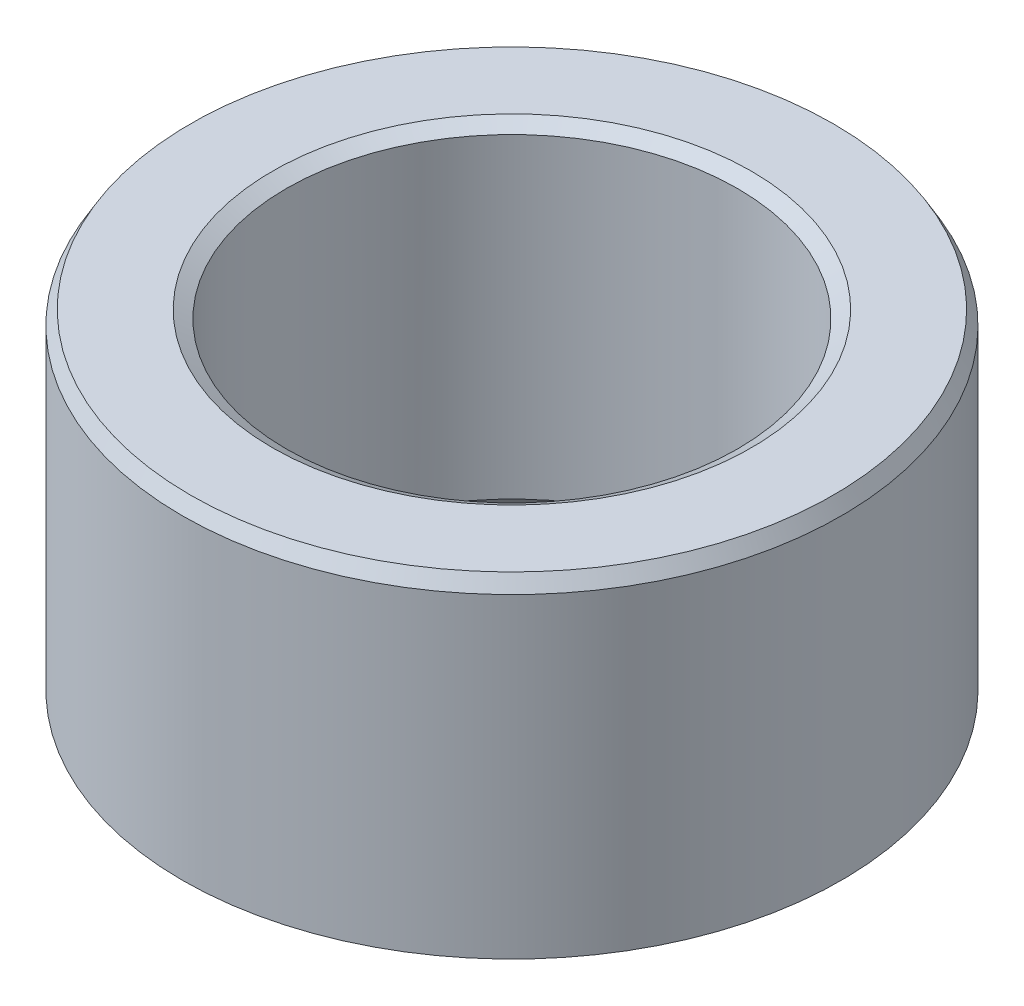
ISO-10303-21;
HEADER;
FILE_DESCRIPTION(('STEP AP214'),'2;1');
FILE_NAME('part.step','',(''),(''),'','','');
FILE_SCHEMA(('AUTOMOTIVE_DESIGN { 1 0 10303 214 1 1 1 1 }'));
ENDSEC;
DATA;
#1=APPLICATION_CONTEXT('core data for automotive mechanical design processes');
#2=APPLICATION_PROTOCOL_DEFINITION('international standard','automotive_design',2000,#1);
#3=PRODUCT_CONTEXT('',#1,'mechanical');
#4=PRODUCT('Part','Part','',(#3));
#5=PRODUCT_RELATED_PRODUCT_CATEGORY('part','',(#4));
#6=PRODUCT_DEFINITION_FORMATION('','',#4);
#7=PRODUCT_DEFINITION_CONTEXT('part definition',#1,'design');
#8=PRODUCT_DEFINITION('design','',#6,#7);
#9=PRODUCT_DEFINITION_SHAPE('','',#8);
#10=(LENGTH_UNIT() NAMED_UNIT(*) SI_UNIT(.MILLI.,.METRE.));
#11=(NAMED_UNIT(*) PLANE_ANGLE_UNIT() SI_UNIT($,.RADIAN.));
#12=(NAMED_UNIT(*) SI_UNIT($,.STERADIAN.) SOLID_ANGLE_UNIT());
#13=UNCERTAINTY_MEASURE_WITH_UNIT(LENGTH_MEASURE(1.E-05),#10,'distance_accuracy_value','');
#14=(GEOMETRIC_REPRESENTATION_CONTEXT(3) GLOBAL_UNCERTAINTY_ASSIGNED_CONTEXT((#13)) GLOBAL_UNIT_ASSIGNED_CONTEXT((#10,
#11,#12)) REPRESENTATION_CONTEXT('',''));
#15=CARTESIAN_POINT('',(0.,0.,0.));
#16=DIRECTION('',(0.,0.,1.));
#17=DIRECTION('',(1.,0.,0.));
#18=AXIS2_PLACEMENT_3D('',#15,#16,#17);
#19=CARTESIAN_POINT('',(0.,17.9271882621692,0.));
#20=DIRECTION('',(0.,-1.,0.));
#21=DIRECTION('',(0.,0.,-1.));
#22=AXIS2_PLACEMENT_3D('',#19,#20,#21);
#23=CYLINDRICAL_SURFACE('',#22,17.5);
#24=CARTESIAN_POINT('',(0.,0.426756121001234,0.));
#25=DIRECTION('',(0.,1.,0.));
#26=DIRECTION('',(0.,0.,1.));
#27=AXIS2_PLACEMENT_3D('',#24,#25,#26);
#28=CIRCLE('',#27,17.5);
#29=CARTESIAN_POINT('',(0.,0.426756121001234,17.5));
#30=VERTEX_POINT('',#29);
#31=EDGE_CURVE('E10',#30,#30,#28,.T.);
#32=ORIENTED_EDGE('',*,*,#31,.T.);
#33=EDGE_LOOP('',(#32));
#34=FACE_BOUND('',#33,.T.);
#35=CARTESIAN_POINT('',(0.,17.1880249781541,0.));
#36=DIRECTION('',(0.,1.,0.));
#37=DIRECTION('',(0.,0.,1.));
#38=AXIS2_PLACEMENT_3D('',#35,#36,#37);
#39=CIRCLE('',#38,17.5);
#40=CARTESIAN_POINT('',(0.,17.1880249781541,17.5));
#41=VERTEX_POINT('',#40);
#42=EDGE_CURVE('E50',#41,#41,#39,.F.);
#43=ORIENTED_EDGE('',*,*,#42,.T.);
#44=EDGE_LOOP('',(#43));
#45=FACE_BOUND('',#44,.T.);
#46=ADVANCED_FACE('F39',(#34,#45),#23,.T.);
#47=CARTESIAN_POINT('',(0.,17.9271882621692,0.));
#48=DIRECTION('',(0.,1.,0.));
#49=DIRECTION('',(0.,0.,1.));
#50=AXIS2_PLACEMENT_3D('',#47,#48,#49);
#51=PLANE('',#50);
#52=CARTESIAN_POINT('',(0.,17.9271882621692,0.));
#53=DIRECTION('',(0.,1.,0.));
#54=DIRECTION('',(0.,0.,1.));
#55=AXIS2_PLACEMENT_3D('',#52,#53,#54);
#56=CIRCLE('',#55,12.7193920259785);
#57=CARTESIAN_POINT('',(0.,17.9271882621692,12.7193920259785));
#58=VERTEX_POINT('',#57);
#59=EDGE_CURVE('E58',#58,#58,#56,.F.);
#60=ORIENTED_EDGE('',*,*,#59,.T.);
#61=EDGE_LOOP('',(#60));
#62=FACE_BOUND('',#61,.T.);
#63=CARTESIAN_POINT('',(0.,17.9271882621692,0.));
#64=DIRECTION('',(0.,1.,0.));
#65=DIRECTION('',(0.,0.,1.));
#66=AXIS2_PLACEMENT_3D('',#63,#64,#65);
#67=CIRCLE('',#66,17.0732438789988);
#68=CARTESIAN_POINT('',(0.,17.9271882621692,17.0732438789988));
#69=VERTEX_POINT('',#68);
#70=EDGE_CURVE('E61',#69,#69,#67,.T.);
#71=ORIENTED_EDGE('',*,*,#70,.T.);
#72=EDGE_LOOP('',(#71));
#73=FACE_BOUND('',#72,.T.);
#74=ADVANCED_FACE('F88',(#62,#73),#51,.T.);
#75=CARTESIAN_POINT('',(0.,0.,0.));
#76=DIRECTION('',(0.,1.,0.));
#77=DIRECTION('',(0.,0.,1.));
#78=AXIS2_PLACEMENT_3D('',#75,#76,#77);
#79=PLANE('',#78);
#80=CARTESIAN_POINT('',(0.,0.,0.));
#81=DIRECTION('',(0.,1.,0.));
#82=DIRECTION('',(0.,0.,1.));
#83=AXIS2_PLACEMENT_3D('',#80,#81,#82);
#84=CIRCLE('',#83,12.4069848629646);
#85=CARTESIAN_POINT('',(0.,0.,-12.4069848629646));
#86=VERTEX_POINT('',#85);
#87=EDGE_CURVE('E51',#86,#86,#84,.T.);
#88=ORIENTED_EDGE('',*,*,#87,.T.);
#89=EDGE_LOOP('',(#88));
#90=FACE_BOUND('',#89,.T.);
#91=CARTESIAN_POINT('',(0.,0.,0.));
#92=DIRECTION('',(0.,1.,0.));
#93=DIRECTION('',(0.,0.,1.));
#94=AXIS2_PLACEMENT_3D('',#91,#92,#93);
#95=CIRCLE('',#94,16.7608367159848);
#96=CARTESIAN_POINT('',(0.,0.,16.7608367159848));
#97=VERTEX_POINT('',#96);
#98=EDGE_CURVE('E54',#97,#97,#95,.F.);
#99=ORIENTED_EDGE('',*,*,#98,.T.);
#100=EDGE_LOOP('',(#99));
#101=FACE_BOUND('',#100,.T.);
#102=ADVANCED_FACE('F83',(#90,#101),#79,.F.);
#103=CARTESIAN_POINT('',(0.,17.9271882621692,0.));
#104=DIRECTION('',(0.,-1.,0.));
#105=DIRECTION('',(0.,0.,-1.));
#106=AXIS2_PLACEMENT_3D('',#103,#104,#105);
#107=CYLINDRICAL_SURFACE('',#106,11.9802287419634);
#108=CARTESIAN_POINT('',(0.,17.500432141168,0.));
#109=DIRECTION('',(0.,1.,0.));
#110=DIRECTION('',(0.,0.,1.));
#111=AXIS2_PLACEMENT_3D('',#108,#109,#110);
#112=CIRCLE('',#111,11.9802287419634);
#113=CARTESIAN_POINT('',(0.,17.500432141168,11.9802287419634));
#114=VERTEX_POINT('',#113);
#115=EDGE_CURVE('E67',#114,#114,#112,.T.);
#116=ORIENTED_EDGE('',*,*,#115,.T.);
#117=EDGE_LOOP('',(#116));
#118=FACE_BOUND('',#117,.T.);
#119=CARTESIAN_POINT('',(0.,0.739163284015149,0.));
#120=DIRECTION('',(0.,1.,0.));
#121=DIRECTION('',(0.,0.,1.));
#122=AXIS2_PLACEMENT_3D('',#119,#120,#121);
#123=CIRCLE('',#122,11.9802287419634);
#124=CARTESIAN_POINT('',(0.,0.739163284015149,-11.9802287419634));
#125=VERTEX_POINT('',#124);
#126=EDGE_CURVE('E69',#125,#125,#123,.F.);
#127=ORIENTED_EDGE('',*,*,#126,.T.);
#128=EDGE_LOOP('',(#127));
#129=FACE_BOUND('',#128,.T.);
#130=ADVANCED_FACE('F71',(#118,#129),#107,.F.);
#131=CARTESIAN_POINT('',(0.,17.500432141168,0.));
#132=DIRECTION('',(0.,1.,0.));
#133=DIRECTION('',(0.,0.,1.));
#134=AXIS2_PLACEMENT_3D('',#131,#132,#133);
#135=CONICAL_SURFACE('',#134,11.9802287419634,1.0471975511966);
#136=ORIENTED_EDGE('',*,*,#59,.F.);
#137=EDGE_LOOP('',(#136));
#138=FACE_BOUND('',#137,.T.);
#139=ORIENTED_EDGE('',*,*,#115,.F.);
#140=EDGE_LOOP('',(#139));
#141=FACE_BOUND('',#140,.T.);
#142=ADVANCED_FACE('F77',(#138,#141),#135,.F.);
#143=CARTESIAN_POINT('',(0.,0.,0.));
#144=DIRECTION('',(0.,-1.,0.));
#145=DIRECTION('',(0.,0.,-1.));
#146=AXIS2_PLACEMENT_3D('',#143,#144,#145);
#147=CONICAL_SURFACE('',#146,12.4069848629646,0.523598775598295);
#148=CARTESIAN_POINT('',(0.,0.739163284015149,-11.9802287419634));
#149=CARTESIAN_POINT('',(0.,0.731463666473325,-11.9846741182238));
#150=CARTESIAN_POINT('',(0.,0.7237640489315,-11.9891194944842));
#151=CARTESIAN_POINT('',(0.,0.708364813847851,-11.9980102470051));
#152=CARTESIAN_POINT('',(0.,0.700665196306027,-12.0024556232655));
#153=CARTESIAN_POINT('',(0.,0.685265961222378,-12.0113463757864));
#154=CARTESIAN_POINT('',(0.,0.677566343680554,-12.0157917520468));
#155=CARTESIAN_POINT('',(0.,0.662167108596905,-12.0246825045677));
#156=CARTESIAN_POINT('',(0.,0.65446749105508,-12.0291278808281));
#157=CARTESIAN_POINT('',(0.,0.639068255971431,-12.038018633349));
#158=CARTESIAN_POINT('',(0.,0.631368638429606,-12.0424640096094));
#159=CARTESIAN_POINT('',(0.,0.615969403345958,-12.0513547621302));
#160=CARTESIAN_POINT('',(0.,0.608269785804133,-12.0558001383907));
#161=CARTESIAN_POINT('',(0.,0.592870550720484,-12.0646908909115));
#162=CARTESIAN_POINT('',(0.,0.58517093317866,-12.069136267172));
#163=CARTESIAN_POINT('',(0.,0.569771698095011,-12.0780270196928));
#164=CARTESIAN_POINT('',(0.,0.562072080553186,-12.0824723959533));
#165=CARTESIAN_POINT('',(0.,0.546672845469537,-12.0913631484741));
#166=CARTESIAN_POINT('',(0.,0.538973227927713,-12.0958085247345));
#167=CARTESIAN_POINT('',(0.,0.523573992844064,-12.1046992772554));
#168=CARTESIAN_POINT('',(0.,0.515874375302239,-12.1091446535158));
#169=CARTESIAN_POINT('',(0.,0.500475140218591,-12.1180354060367));
#170=CARTESIAN_POINT('',(0.,0.492775522676766,-12.1224807822971));
#171=CARTESIAN_POINT('',(0.,0.477376287593117,-12.131371534818));
#172=CARTESIAN_POINT('',(0.,0.469676670051293,-12.1358169110784));
#173=CARTESIAN_POINT('',(0.,0.454277434967644,-12.1447076635993));
#174=CARTESIAN_POINT('',(0.,0.446577817425819,-12.1491530398597));
#175=CARTESIAN_POINT('',(0.,0.43117858234217,-12.1580437923806));
#176=CARTESIAN_POINT('',(0.,0.423478964800346,-12.162489168641));
#177=CARTESIAN_POINT('',(0.,0.408079729716697,-12.1713799211618));
#178=CARTESIAN_POINT('',(0.,0.400380112174872,-12.1758252974223));
#179=CARTESIAN_POINT('',(0.,0.384980877091223,-12.1847160499431));
#180=CARTESIAN_POINT('',(0.,0.377281259549399,-12.1891614262036));
#181=CARTESIAN_POINT('',(0.,0.36188202446575,-12.1980521787244));
#182=CARTESIAN_POINT('',(0.,0.354182406923926,-12.2024975549848));
#183=CARTESIAN_POINT('',(0.,0.338783171840277,-12.2113883075057));
#184=CARTESIAN_POINT('',(0.,0.331083554298452,-12.2158336837661));
#185=CARTESIAN_POINT('',(0.,0.315684319214803,-12.224724436287));
#186=CARTESIAN_POINT('',(0.,0.307984701672979,-12.2291698125474));
#187=CARTESIAN_POINT('',(0.,0.29258546658933,-12.2380605650683));
#188=CARTESIAN_POINT('',(0.,0.284885849047505,-12.2425059413287));
#189=CARTESIAN_POINT('',(0.,0.269486613963856,-12.2513966938496));
#190=CARTESIAN_POINT('',(0.,0.261786996422032,-12.25584207011));
#191=CARTESIAN_POINT('',(0.,0.246387761338383,-12.2647328226309));
#192=CARTESIAN_POINT('',(0.,0.238688143796559,-12.2691781988913));
#193=CARTESIAN_POINT('',(0.,0.22328890871291,-12.2780689514121));
#194=CARTESIAN_POINT('',(0.,0.215589291171085,-12.2825143276726));
#195=CARTESIAN_POINT('',(0.,0.200190056087436,-12.2914050801934));
#196=CARTESIAN_POINT('',(0.,0.192490438545612,-12.2958504564539));
#197=CARTESIAN_POINT('',(0.,0.177091203461963,-12.3047412089747));
#198=CARTESIAN_POINT('',(0.,0.169391585920138,-12.3091865852352));
#199=CARTESIAN_POINT('',(0.,0.153992350836489,-12.318077337756));
#200=CARTESIAN_POINT('',(0.,0.146292733294665,-12.3225227140164));
#201=CARTESIAN_POINT('',(0.,0.130893498211016,-12.3314134665373));
#202=CARTESIAN_POINT('',(0.,0.123193880669191,-12.3358588427977));
#203=CARTESIAN_POINT('',(0.,0.107794645585543,-12.3447495953186));
#204=CARTESIAN_POINT('',(0.,0.100095028043718,-12.349194971579));
#205=CARTESIAN_POINT('',(0.,0.0846957929600693,-12.3580857240999));
#206=CARTESIAN_POINT('',(0.,0.0769961754182446,-12.3625311003603));
#207=CARTESIAN_POINT('',(0.,0.0615969403345956,-12.3714218528812));
#208=CARTESIAN_POINT('',(0.,0.0538973227927712,-12.3758672291416));
#209=CARTESIAN_POINT('',(0.,0.0384980877091224,-12.3847579816625));
#210=CARTESIAN_POINT('',(0.,0.0307984701672979,-12.3892033579229));
#211=CARTESIAN_POINT('',(0.,0.0153992350836489,-12.3980941104437));
#212=CARTESIAN_POINT('',(0.,0.00769961754182442,-12.4025394867042));
#213=CARTESIAN_POINT('',(0.,0.,-12.4069848629646));
#214=B_SPLINE_CURVE_WITH_KNOTS('',3,(#148,#149,#150,#151,#152,#153,#154,#155,#156,#157,#158,
#159,#160,#161,#162,#163,#164,#165,#166,#167,#168,#169,#170,#171,#172,#173,#174,#175,#176,#177,
#178,#179,#180,#181,#182,#183,#184,#185,#186,#187,#188,#189,#190,#191,#192,#193,#194,#195,#196,
#197,#198,#199,#200,#201,#202,#203,#204,#205,#206,#207,#208,#209,#210,#211,#212,#213),
.UNSPECIFIED.,.F.,.F.,(4,2,2,2,2,2,2,2,2,2,2,2,2,2,2,2,2,2,2,2,2,2,2,2,2,2,2,2,2,2,2,2,4),(0.,
0.0266722575625772,0.0533445151251544,0.0800167726877316,0.106689030250308,0.133361287812885,
0.160033545375462,0.186705802938039,0.213378060500617,0.240050318063194,0.266722575625771,
0.293394833188348,0.320067090750925,0.346739348313502,0.373411605876079,0.400083863438656,
0.426756121001233,0.45342837856381,0.480100636126387,0.506772893688965,0.533445151251541,
0.560117408814118,0.586789666376695,0.613461923939272,0.64013418150185,0.666806439064427,
0.693478696627004,0.720150954189581,0.746823211752158,0.773495469314735,0.800167726877312,
0.826839984439889,0.853512242002467),.UNSPECIFIED.);
#215=EDGE_CURVE('BSEAM73',#125,#86,#214,.T.);
#216=ORIENTED_EDGE('',*,*,#126,.F.);
#217=ORIENTED_EDGE('',*,*,#87,.F.);
#218=ORIENTED_EDGE('',*,*,#215,.T.);
#219=ORIENTED_EDGE('',*,*,#215,.F.);
#220=EDGE_LOOP('',(#216,#218,#217,#219));
#221=FACE_BOUND('',#220,.T.);
#222=ADVANCED_FACE('F73',(#221),#147,.F.);
#223=CARTESIAN_POINT('',(0.,0.426756121001234,0.));
#224=DIRECTION('',(0.,1.,0.));
#225=DIRECTION('',(0.,0.,1.));
#226=AXIS2_PLACEMENT_3D('',#223,#224,#225);
#227=CONICAL_SURFACE('',#226,17.5,1.0471975511966);
#228=ORIENTED_EDGE('',*,*,#98,.F.);
#229=EDGE_LOOP('',(#228));
#230=FACE_BOUND('',#229,.T.);
#231=ORIENTED_EDGE('',*,*,#31,.F.);
#232=EDGE_LOOP('',(#231));
#233=FACE_BOUND('',#232,.T.);
#234=ADVANCED_FACE('F76',(#230,#233),#227,.T.);
#235=CARTESIAN_POINT('',(0.,17.9271882621692,0.));
#236=DIRECTION('',(0.,-1.,0.));
#237=DIRECTION('',(0.,0.,-1.));
#238=AXIS2_PLACEMENT_3D('',#235,#236,#237);
#239=CONICAL_SURFACE('',#238,17.0732438789988,0.523598775598294);
#240=ORIENTED_EDGE('',*,*,#42,.F.);
#241=EDGE_LOOP('',(#240));
#242=FACE_BOUND('',#241,.T.);
#243=ORIENTED_EDGE('',*,*,#70,.F.);
#244=EDGE_LOOP('',(#243));
#245=FACE_BOUND('',#244,.T.);
#246=ADVANCED_FACE('F45',(#242,#245),#239,.T.);
#247=CLOSED_SHELL('',(#46,#74,#102,#130,#142,#222,#234,#246));
#248=MANIFOLD_SOLID_BREP('B2',#247);
#249=ADVANCED_BREP_SHAPE_REPRESENTATION('',(#18,#248),#14);
#250=SHAPE_DEFINITION_REPRESENTATION(#9,#249);
ENDSEC;
END-ISO-10303-21;
